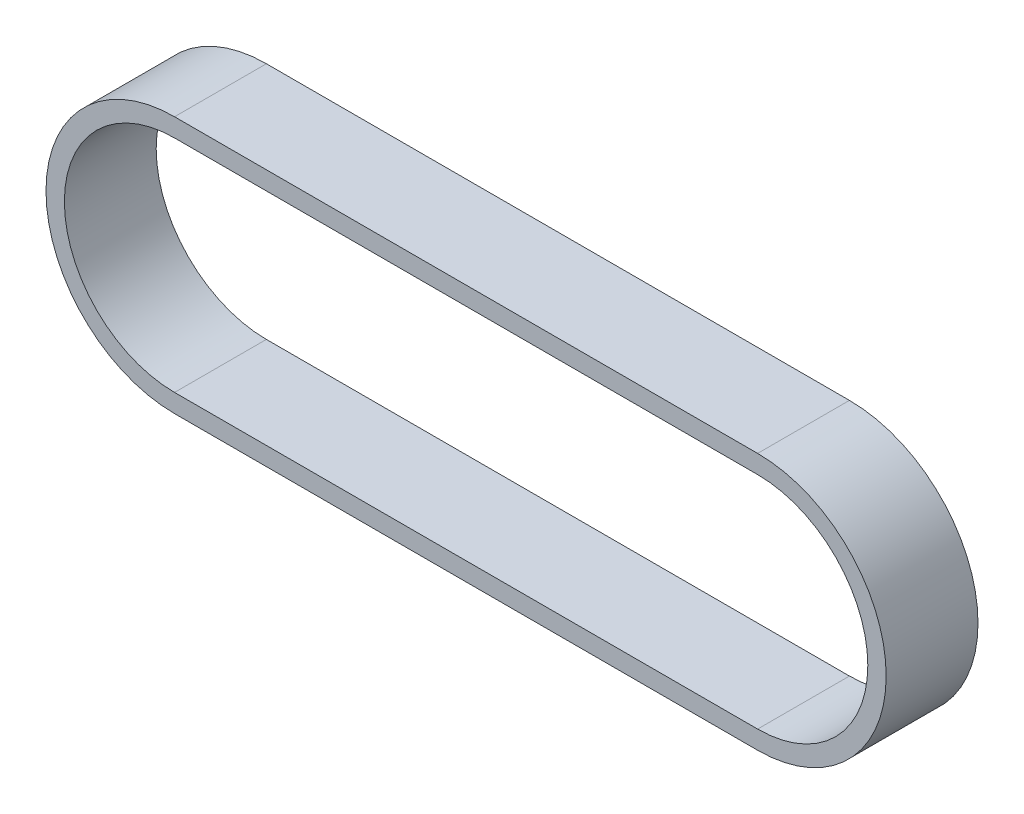
ISO-10303-21;
HEADER;
FILE_DESCRIPTION(('STEP AP214'),'2;1');
FILE_NAME('part.step','',(''),(''),'','','');
FILE_SCHEMA(('AUTOMOTIVE_DESIGN { 1 0 10303 214 1 1 1 1 }'));
ENDSEC;
DATA;
#1=APPLICATION_CONTEXT('core data for automotive mechanical design processes');
#2=APPLICATION_PROTOCOL_DEFINITION('international standard','automotive_design',2000,#1);
#3=PRODUCT_CONTEXT('',#1,'mechanical');
#4=PRODUCT('Part','Part','',(#3));
#5=PRODUCT_RELATED_PRODUCT_CATEGORY('part','',(#4));
#6=PRODUCT_DEFINITION_FORMATION('','',#4);
#7=PRODUCT_DEFINITION_CONTEXT('part definition',#1,'design');
#8=PRODUCT_DEFINITION('design','',#6,#7);
#9=PRODUCT_DEFINITION_SHAPE('','',#8);
#10=(LENGTH_UNIT() NAMED_UNIT(*) SI_UNIT(.MILLI.,.METRE.));
#11=(NAMED_UNIT(*) PLANE_ANGLE_UNIT() SI_UNIT($,.RADIAN.));
#12=(NAMED_UNIT(*) SI_UNIT($,.STERADIAN.) SOLID_ANGLE_UNIT());
#13=UNCERTAINTY_MEASURE_WITH_UNIT(LENGTH_MEASURE(1.E-05),#10,'distance_accuracy_value','');
#14=(GEOMETRIC_REPRESENTATION_CONTEXT(3) GLOBAL_UNCERTAINTY_ASSIGNED_CONTEXT((#13)) GLOBAL_UNIT_ASSIGNED_CONTEXT((#10,
#11,#12)) REPRESENTATION_CONTEXT('',''));
#15=CARTESIAN_POINT('',(0.,0.,0.));
#16=DIRECTION('',(0.,0.,1.));
#17=DIRECTION('',(1.,0.,0.));
#18=AXIS2_PLACEMENT_3D('',#15,#16,#17);
#19=CARTESIAN_POINT('',(0.,0.,10.));
#20=DIRECTION('',(0.,0.,1.));
#21=DIRECTION('',(1.,0.,0.));
#22=AXIS2_PLACEMENT_3D('',#19,#20,#21);
#23=PLANE('',#22);
#24=CARTESIAN_POINT('',(0.,0.,10.));
#25=DIRECTION('',(0.,0.,1.));
#26=DIRECTION('',(1.,0.,0.));
#27=AXIS2_PLACEMENT_3D('',#24,#25,#26);
#28=CIRCLE('',#27,14.);
#29=CARTESIAN_POINT('',(0.,14.,10.));
#30=VERTEX_POINT('',#29);
#31=CARTESIAN_POINT('',(0.,-14.,10.));
#32=VERTEX_POINT('',#31);
#33=EDGE_CURVE('E144',#30,#32,#28,.T.);
#34=ORIENTED_EDGE('',*,*,#33,.T.);
#35=DIRECTION('',(1.,0.,0.));
#36=VECTOR('',#35,1.);
#37=CARTESIAN_POINT('',(0.,-14.,10.));
#38=LINE('',#37,#36);
#39=CARTESIAN_POINT('',(63.5,-14.,10.));
#40=VERTEX_POINT('',#39);
#41=EDGE_CURVE('E147',#32,#40,#38,.T.);
#42=ORIENTED_EDGE('',*,*,#41,.T.);
#43=CARTESIAN_POINT('',(63.5,0.,10.));
#44=DIRECTION('',(0.,0.,1.));
#45=DIRECTION('',(1.,0.,0.));
#46=AXIS2_PLACEMENT_3D('',#43,#44,#45);
#47=CIRCLE('',#46,14.);
#48=CARTESIAN_POINT('',(63.5,14.,10.));
#49=VERTEX_POINT('',#48);
#50=EDGE_CURVE('E150',#40,#49,#47,.T.);
#51=ORIENTED_EDGE('',*,*,#50,.T.);
#52=DIRECTION('',(-1.,0.,0.));
#53=VECTOR('',#52,1.);
#54=CARTESIAN_POINT('',(0.,14.,10.));
#55=LINE('',#54,#53);
#56=EDGE_CURVE('E152',#49,#30,#55,.T.);
#57=ORIENTED_EDGE('',*,*,#56,.T.);
#58=EDGE_LOOP('',(#34,#42,#51,#57));
#59=FACE_BOUND('',#58,.T.);
#60=DIRECTION('',(1.,0.,0.));
#61=VECTOR('',#60,1.);
#62=CARTESIAN_POINT('',(0.,-12.,10.));
#63=LINE('',#62,#61);
#64=CARTESIAN_POINT('',(0.,-12.,10.));
#65=VERTEX_POINT('',#64);
#66=CARTESIAN_POINT('',(63.5,-12.,10.));
#67=VERTEX_POINT('',#66);
#68=EDGE_CURVE('E116',#65,#67,#63,.T.);
#69=ORIENTED_EDGE('',*,*,#68,.F.);
#70=CARTESIAN_POINT('',(0.,0.,10.));
#71=DIRECTION('',(0.,0.,1.));
#72=DIRECTION('',(1.,0.,0.));
#73=AXIS2_PLACEMENT_3D('',#70,#71,#72);
#74=CIRCLE('',#73,12.);
#75=CARTESIAN_POINT('',(0.,12.,10.));
#76=VERTEX_POINT('',#75);
#77=EDGE_CURVE('E108',#76,#65,#74,.T.);
#78=ORIENTED_EDGE('',*,*,#77,.F.);
#79=DIRECTION('',(-1.,0.,0.));
#80=VECTOR('',#79,1.);
#81=CARTESIAN_POINT('',(0.,12.,10.));
#82=LINE('',#81,#80);
#83=CARTESIAN_POINT('',(63.5,12.,10.));
#84=VERTEX_POINT('',#83);
#85=EDGE_CURVE('E130',#84,#76,#82,.T.);
#86=ORIENTED_EDGE('',*,*,#85,.F.);
#87=CARTESIAN_POINT('',(63.5,0.,10.));
#88=DIRECTION('',(0.,0.,1.));
#89=DIRECTION('',(1.,0.,0.));
#90=AXIS2_PLACEMENT_3D('',#87,#88,#89);
#91=CIRCLE('',#90,12.);
#92=EDGE_CURVE('E128',#67,#84,#91,.T.);
#93=ORIENTED_EDGE('',*,*,#92,.F.);
#94=EDGE_LOOP('',(#69,#78,#86,#93));
#95=FACE_BOUND('',#94,.T.);
#96=ADVANCED_FACE('F43',(#59,#95),#23,.T.);
#97=CARTESIAN_POINT('',(0.,0.,0.));
#98=DIRECTION('',(0.,0.,1.));
#99=DIRECTION('',(1.,0.,0.));
#100=AXIS2_PLACEMENT_3D('',#97,#98,#99);
#101=PLANE('',#100);
#102=CARTESIAN_POINT('',(0.,0.,0.));
#103=DIRECTION('',(0.,0.,1.));
#104=DIRECTION('',(1.,0.,0.));
#105=AXIS2_PLACEMENT_3D('',#102,#103,#104);
#106=CIRCLE('',#105,14.);
#107=CARTESIAN_POINT('',(0.,14.,0.));
#108=VERTEX_POINT('',#107);
#109=CARTESIAN_POINT('',(0.,-14.,0.));
#110=VERTEX_POINT('',#109);
#111=EDGE_CURVE('E124',#108,#110,#106,.T.);
#112=ORIENTED_EDGE('',*,*,#111,.F.);
#113=DIRECTION('',(-1.,0.,0.));
#114=VECTOR('',#113,1.);
#115=CARTESIAN_POINT('',(0.,14.,0.));
#116=LINE('',#115,#114);
#117=CARTESIAN_POINT('',(63.5,14.,0.));
#118=VERTEX_POINT('',#117);
#119=EDGE_CURVE('E148',#118,#108,#116,.T.);
#120=ORIENTED_EDGE('',*,*,#119,.F.);
#121=CARTESIAN_POINT('',(63.5,0.,0.));
#122=DIRECTION('',(0.,0.,1.));
#123=DIRECTION('',(1.,0.,0.));
#124=AXIS2_PLACEMENT_3D('',#121,#122,#123);
#125=CIRCLE('',#124,14.);
#126=CARTESIAN_POINT('',(63.5,-14.,0.));
#127=VERTEX_POINT('',#126);
#128=EDGE_CURVE('E159',#127,#118,#125,.T.);
#129=ORIENTED_EDGE('',*,*,#128,.F.);
#130=DIRECTION('',(1.,0.,0.));
#131=VECTOR('',#130,1.);
#132=CARTESIAN_POINT('',(0.,-14.,0.));
#133=LINE('',#132,#131);
#134=EDGE_CURVE('E157',#110,#127,#133,.T.);
#135=ORIENTED_EDGE('',*,*,#134,.F.);
#136=EDGE_LOOP('',(#112,#120,#129,#135));
#137=FACE_BOUND('',#136,.T.);
#138=CARTESIAN_POINT('',(0.,0.,0.));
#139=DIRECTION('',(0.,0.,1.));
#140=DIRECTION('',(1.,0.,0.));
#141=AXIS2_PLACEMENT_3D('',#138,#139,#140);
#142=CIRCLE('',#141,12.);
#143=CARTESIAN_POINT('',(0.,12.,0.));
#144=VERTEX_POINT('',#143);
#145=CARTESIAN_POINT('',(0.,-12.,0.));
#146=VERTEX_POINT('',#145);
#147=EDGE_CURVE('E66',#144,#146,#142,.T.);
#148=ORIENTED_EDGE('',*,*,#147,.T.);
#149=DIRECTION('',(1.,0.,0.));
#150=VECTOR('',#149,1.);
#151=CARTESIAN_POINT('',(0.,-12.,0.));
#152=LINE('',#151,#150);
#153=CARTESIAN_POINT('',(63.5,-12.,0.));
#154=VERTEX_POINT('',#153);
#155=EDGE_CURVE('E123',#146,#154,#152,.T.);
#156=ORIENTED_EDGE('',*,*,#155,.T.);
#157=CARTESIAN_POINT('',(63.5,0.,0.));
#158=DIRECTION('',(0.,0.,1.));
#159=DIRECTION('',(1.,0.,0.));
#160=AXIS2_PLACEMENT_3D('',#157,#158,#159);
#161=CIRCLE('',#160,12.);
#162=CARTESIAN_POINT('',(63.5,12.,0.));
#163=VERTEX_POINT('',#162);
#164=EDGE_CURVE('E136',#154,#163,#161,.T.);
#165=ORIENTED_EDGE('',*,*,#164,.T.);
#166=DIRECTION('',(-1.,0.,0.));
#167=VECTOR('',#166,1.);
#168=CARTESIAN_POINT('',(0.,12.,0.));
#169=LINE('',#168,#167);
#170=EDGE_CURVE('E117',#163,#144,#169,.T.);
#171=ORIENTED_EDGE('',*,*,#170,.T.);
#172=EDGE_LOOP('',(#148,#156,#165,#171));
#173=FACE_BOUND('',#172,.T.);
#174=ADVANCED_FACE('F177',(#137,#173),#101,.F.);
#175=CARTESIAN_POINT('',(0.,0.,10.));
#176=DIRECTION('',(0.,0.,-1.));
#177=DIRECTION('',(-1.,0.,0.));
#178=AXIS2_PLACEMENT_3D('',#175,#176,#177);
#179=CYLINDRICAL_SURFACE('',#178,14.);
#180=ORIENTED_EDGE('',*,*,#111,.T.);
#181=DIRECTION('',(0.,0.,-1.));
#182=VECTOR('',#181,1.);
#183=CARTESIAN_POINT('',(0.,-14.,10.));
#184=LINE('',#183,#182);
#185=EDGE_CURVE('E11',#32,#110,#184,.T.);
#186=ORIENTED_EDGE('',*,*,#185,.F.);
#187=ORIENTED_EDGE('',*,*,#33,.F.);
#188=DIRECTION('',(0.,0.,-1.));
#189=VECTOR('',#188,1.);
#190=CARTESIAN_POINT('',(0.,14.,10.));
#191=LINE('',#190,#189);
#192=EDGE_CURVE('E154',#30,#108,#191,.T.);
#193=ORIENTED_EDGE('',*,*,#192,.T.);
#194=EDGE_LOOP('',(#180,#186,#187,#193));
#195=FACE_BOUND('',#194,.T.);
#196=ADVANCED_FACE('F45',(#195),#179,.T.);
#197=CARTESIAN_POINT('',(0.,-14.,10.));
#198=DIRECTION('',(0.,1.,0.));
#199=DIRECTION('',(0.,0.,1.));
#200=AXIS2_PLACEMENT_3D('',#197,#198,#199);
#201=PLANE('',#200);
#202=ORIENTED_EDGE('',*,*,#134,.T.);
#203=DIRECTION('',(0.,0.,-1.));
#204=VECTOR('',#203,1.);
#205=CARTESIAN_POINT('',(63.5,-14.,10.));
#206=LINE('',#205,#204);
#207=EDGE_CURVE('E51',#40,#127,#206,.T.);
#208=ORIENTED_EDGE('',*,*,#207,.F.);
#209=ORIENTED_EDGE('',*,*,#41,.F.);
#210=ORIENTED_EDGE('',*,*,#185,.T.);
#211=EDGE_LOOP('',(#202,#208,#209,#210));
#212=FACE_BOUND('',#211,.T.);
#213=ADVANCED_FACE('F187',(#212),#201,.F.);
#214=CARTESIAN_POINT('',(63.5,0.,10.));
#215=DIRECTION('',(0.,0.,-1.));
#216=DIRECTION('',(-1.,0.,0.));
#217=AXIS2_PLACEMENT_3D('',#214,#215,#216);
#218=CYLINDRICAL_SURFACE('',#217,14.);
#219=ORIENTED_EDGE('',*,*,#128,.T.);
#220=DIRECTION('',(0.,0.,-1.));
#221=VECTOR('',#220,1.);
#222=CARTESIAN_POINT('',(63.5,14.,10.));
#223=LINE('',#222,#221);
#224=EDGE_CURVE('E164',#49,#118,#223,.T.);
#225=ORIENTED_EDGE('',*,*,#224,.F.);
#226=ORIENTED_EDGE('',*,*,#50,.F.);
#227=ORIENTED_EDGE('',*,*,#207,.T.);
#228=EDGE_LOOP('',(#219,#225,#226,#227));
#229=FACE_BOUND('',#228,.T.);
#230=ADVANCED_FACE('F171',(#229),#218,.T.);
#231=CARTESIAN_POINT('',(0.,14.,10.));
#232=DIRECTION('',(0.,-1.,0.));
#233=DIRECTION('',(0.,0.,-1.));
#234=AXIS2_PLACEMENT_3D('',#231,#232,#233);
#235=PLANE('',#234);
#236=ORIENTED_EDGE('',*,*,#119,.T.);
#237=ORIENTED_EDGE('',*,*,#192,.F.);
#238=ORIENTED_EDGE('',*,*,#56,.F.);
#239=ORIENTED_EDGE('',*,*,#224,.T.);
#240=EDGE_LOOP('',(#236,#237,#238,#239));
#241=FACE_BOUND('',#240,.T.);
#242=ADVANCED_FACE('F181',(#241),#235,.F.);
#243=CARTESIAN_POINT('',(0.,0.,10.));
#244=DIRECTION('',(0.,0.,-1.));
#245=DIRECTION('',(-1.,0.,0.));
#246=AXIS2_PLACEMENT_3D('',#243,#244,#245);
#247=CYLINDRICAL_SURFACE('',#246,12.);
#248=ORIENTED_EDGE('',*,*,#147,.F.);
#249=DIRECTION('',(0.,0.,-1.));
#250=VECTOR('',#249,1.);
#251=CARTESIAN_POINT('',(0.,12.,10.));
#252=LINE('',#251,#250);
#253=EDGE_CURVE('E112',#76,#144,#252,.T.);
#254=ORIENTED_EDGE('',*,*,#253,.F.);
#255=ORIENTED_EDGE('',*,*,#77,.T.);
#256=DIRECTION('',(0.,0.,-1.));
#257=VECTOR('',#256,1.);
#258=CARTESIAN_POINT('',(0.,-12.,10.));
#259=LINE('',#258,#257);
#260=EDGE_CURVE('E111',#65,#146,#259,.T.);
#261=ORIENTED_EDGE('',*,*,#260,.T.);
#262=EDGE_LOOP('',(#248,#254,#255,#261));
#263=FACE_BOUND('',#262,.T.);
#264=ADVANCED_FACE('F110',(#263),#247,.F.);
#265=CARTESIAN_POINT('',(0.,-12.,10.));
#266=DIRECTION('',(0.,1.,0.));
#267=DIRECTION('',(0.,0.,1.));
#268=AXIS2_PLACEMENT_3D('',#265,#266,#267);
#269=PLANE('',#268);
#270=ORIENTED_EDGE('',*,*,#155,.F.);
#271=ORIENTED_EDGE('',*,*,#260,.F.);
#272=ORIENTED_EDGE('',*,*,#68,.T.);
#273=DIRECTION('',(0.,0.,-1.));
#274=VECTOR('',#273,1.);
#275=CARTESIAN_POINT('',(63.5,-12.,10.));
#276=LINE('',#275,#274);
#277=EDGE_CURVE('E125',#67,#154,#276,.T.);
#278=ORIENTED_EDGE('',*,*,#277,.T.);
#279=EDGE_LOOP('',(#270,#271,#272,#278));
#280=FACE_BOUND('',#279,.T.);
#281=ADVANCED_FACE('F120',(#280),#269,.T.);
#282=CARTESIAN_POINT('',(63.5,0.,10.));
#283=DIRECTION('',(0.,0.,-1.));
#284=DIRECTION('',(-1.,0.,0.));
#285=AXIS2_PLACEMENT_3D('',#282,#283,#284);
#286=CYLINDRICAL_SURFACE('',#285,12.);
#287=ORIENTED_EDGE('',*,*,#164,.F.);
#288=ORIENTED_EDGE('',*,*,#277,.F.);
#289=ORIENTED_EDGE('',*,*,#92,.T.);
#290=DIRECTION('',(0.,0.,-1.));
#291=VECTOR('',#290,1.);
#292=CARTESIAN_POINT('',(63.5,12.,10.));
#293=LINE('',#292,#291);
#294=EDGE_CURVE('E58',#84,#163,#293,.T.);
#295=ORIENTED_EDGE('',*,*,#294,.T.);
#296=EDGE_LOOP('',(#287,#288,#289,#295));
#297=FACE_BOUND('',#296,.T.);
#298=ADVANCED_FACE('F210',(#297),#286,.F.);
#299=CARTESIAN_POINT('',(0.,12.,10.));
#300=DIRECTION('',(0.,-1.,0.));
#301=DIRECTION('',(0.,0.,-1.));
#302=AXIS2_PLACEMENT_3D('',#299,#300,#301);
#303=PLANE('',#302);
#304=ORIENTED_EDGE('',*,*,#170,.F.);
#305=ORIENTED_EDGE('',*,*,#294,.F.);
#306=ORIENTED_EDGE('',*,*,#85,.T.);
#307=ORIENTED_EDGE('',*,*,#253,.T.);
#308=EDGE_LOOP('',(#304,#305,#306,#307));
#309=FACE_BOUND('',#308,.T.);
#310=ADVANCED_FACE('F214',(#309),#303,.T.);
#311=CLOSED_SHELL('',(#96,#174,#196,#213,#230,#242,#264,#281,#298,#310));
#312=MANIFOLD_SOLID_BREP('B2',#311);
#313=ADVANCED_BREP_SHAPE_REPRESENTATION('',(#18,#312),#14);
#314=SHAPE_DEFINITION_REPRESENTATION(#9,#313);
ENDSEC;
END-ISO-10303-21;
